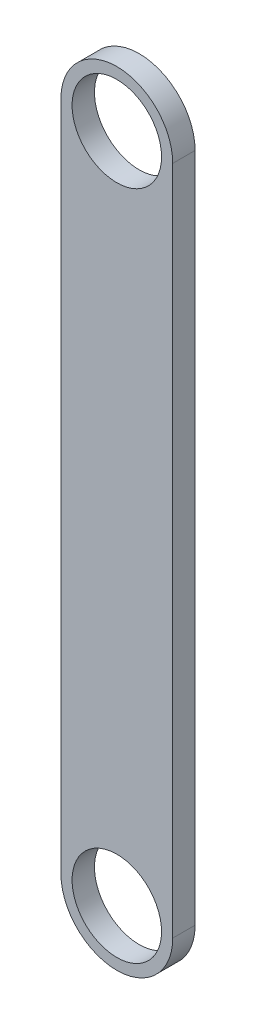
ISO-10303-21;
HEADER;
FILE_DESCRIPTION(('STEP AP214'),'2;1');
FILE_NAME('part.step','',(''),(''),'','','');
FILE_SCHEMA(('AUTOMOTIVE_DESIGN { 1 0 10303 214 1 1 1 1 }'));
ENDSEC;
DATA;
#1=APPLICATION_CONTEXT('core data for automotive mechanical design processes');
#2=APPLICATION_PROTOCOL_DEFINITION('international standard','automotive_design',2000,#1);
#3=PRODUCT_CONTEXT('',#1,'mechanical');
#4=PRODUCT('Part','Part','',(#3));
#5=PRODUCT_RELATED_PRODUCT_CATEGORY('part','',(#4));
#6=PRODUCT_DEFINITION_FORMATION('','',#4);
#7=PRODUCT_DEFINITION_CONTEXT('part definition',#1,'design');
#8=PRODUCT_DEFINITION('design','',#6,#7);
#9=PRODUCT_DEFINITION_SHAPE('','',#8);
#10=(LENGTH_UNIT() NAMED_UNIT(*) SI_UNIT(.MILLI.,.METRE.));
#11=(NAMED_UNIT(*) PLANE_ANGLE_UNIT() SI_UNIT($,.RADIAN.));
#12=(NAMED_UNIT(*) SI_UNIT($,.STERADIAN.) SOLID_ANGLE_UNIT());
#13=UNCERTAINTY_MEASURE_WITH_UNIT(LENGTH_MEASURE(1.E-05),#10,'distance_accuracy_value','');
#14=(GEOMETRIC_REPRESENTATION_CONTEXT(3) GLOBAL_UNCERTAINTY_ASSIGNED_CONTEXT((#13)) GLOBAL_UNIT_ASSIGNED_CONTEXT((#10,
#11,#12)) REPRESENTATION_CONTEXT('',''));
#15=CARTESIAN_POINT('',(0.,0.,0.));
#16=DIRECTION('',(0.,0.,1.));
#17=DIRECTION('',(1.,0.,0.));
#18=AXIS2_PLACEMENT_3D('',#15,#16,#17);
#19=CARTESIAN_POINT('',(2.56665593577974E-13,-15.,5.5));
#20=DIRECTION('',(0.,0.,1.));
#21=DIRECTION('',(1.,0.,0.));
#22=AXIS2_PLACEMENT_3D('',#19,#20,#21);
#23=PLANE('',#22);
#24=CARTESIAN_POINT('',(2.55073552739082E-13,15.,5.5));
#25=DIRECTION('',(0.,0.,1.));
#26=DIRECTION('',(1.,0.,0.));
#27=AXIS2_PLACEMENT_3D('',#24,#25,#26);
#28=CIRCLE('',#27,2.);
#29=CARTESIAN_POINT('',(2.00000000000025,15.,5.5));
#30=VERTEX_POINT('',#29);
#31=EDGE_CURVE('E112',#30,#30,#28,.T.);
#32=ORIENTED_EDGE('',*,*,#31,.F.);
#33=EDGE_LOOP('',(#32));
#34=FACE_BOUND('',#33,.T.);
#35=CARTESIAN_POINT('',(2.56665593577974E-13,-15.,5.5));
#36=DIRECTION('',(0.,0.,1.));
#37=DIRECTION('',(1.,0.,0.));
#38=AXIS2_PLACEMENT_3D('',#35,#36,#37);
#39=CIRCLE('',#38,2.5);
#40=CARTESIAN_POINT('',(-2.49999999999975,-15.,5.5));
#41=VERTEX_POINT('',#40);
#42=CARTESIAN_POINT('',(2.50000000000026,-15.,5.5));
#43=VERTEX_POINT('',#42);
#44=EDGE_CURVE('E92',#41,#43,#39,.T.);
#45=ORIENTED_EDGE('',*,*,#44,.T.);
#46=DIRECTION('',(0.,1.,0.));
#47=VECTOR('',#46,1.);
#48=CARTESIAN_POINT('',(2.50000000000026,-15.,5.5));
#49=LINE('',#48,#47);
#50=CARTESIAN_POINT('',(2.50000000000026,15.,5.5));
#51=VERTEX_POINT('',#50);
#52=EDGE_CURVE('E87',#43,#51,#49,.T.);
#53=ORIENTED_EDGE('',*,*,#52,.T.);
#54=CARTESIAN_POINT('',(2.55073552739082E-13,15.,5.5));
#55=DIRECTION('',(0.,0.,1.));
#56=DIRECTION('',(1.,0.,0.));
#57=AXIS2_PLACEMENT_3D('',#54,#55,#56);
#58=CIRCLE('',#57,2.5);
#59=CARTESIAN_POINT('',(-2.49999999999975,15.,5.5));
#60=VERTEX_POINT('',#59);
#61=EDGE_CURVE('E90',#51,#60,#58,.T.);
#62=ORIENTED_EDGE('',*,*,#61,.T.);
#63=DIRECTION('',(0.,-1.,0.));
#64=VECTOR('',#63,1.);
#65=CARTESIAN_POINT('',(-2.49999999999975,-15.,5.5));
#66=LINE('',#65,#64);
#67=EDGE_CURVE('E57',#60,#41,#66,.T.);
#68=ORIENTED_EDGE('',*,*,#67,.T.);
#69=EDGE_LOOP('',(#45,#53,#62,#68));
#70=FACE_BOUND('',#69,.T.);
#71=CARTESIAN_POINT('',(2.56665593577974E-13,-15.,5.5));
#72=DIRECTION('',(0.,0.,1.));
#73=DIRECTION('',(1.,0.,0.));
#74=AXIS2_PLACEMENT_3D('',#71,#72,#73);
#75=CIRCLE('',#74,2.);
#76=CARTESIAN_POINT('',(2.00000000000026,-15.,5.5));
#77=VERTEX_POINT('',#76);
#78=EDGE_CURVE('E134',#77,#77,#75,.T.);
#79=ORIENTED_EDGE('',*,*,#78,.F.);
#80=EDGE_LOOP('',(#79));
#81=FACE_BOUND('',#80,.T.);
#82=ADVANCED_FACE('F39',(#34,#70,#81),#23,.T.);
#83=CARTESIAN_POINT('',(2.56665593577974E-13,-15.,4.5));
#84=DIRECTION('',(0.,0.,1.));
#85=DIRECTION('',(1.,0.,0.));
#86=AXIS2_PLACEMENT_3D('',#83,#84,#85);
#87=PLANE('',#86);
#88=CARTESIAN_POINT('',(2.56665593577974E-13,-15.,4.5));
#89=DIRECTION('',(0.,0.,1.));
#90=DIRECTION('',(1.,0.,0.));
#91=AXIS2_PLACEMENT_3D('',#88,#89,#90);
#92=CIRCLE('',#91,2.5);
#93=CARTESIAN_POINT('',(-2.49999999999975,-15.,4.5));
#94=VERTEX_POINT('',#93);
#95=CARTESIAN_POINT('',(2.50000000000026,-15.,4.5));
#96=VERTEX_POINT('',#95);
#97=EDGE_CURVE('E108',#94,#96,#92,.T.);
#98=ORIENTED_EDGE('',*,*,#97,.F.);
#99=DIRECTION('',(0.,-1.,0.));
#100=VECTOR('',#99,1.);
#101=CARTESIAN_POINT('',(-2.49999999999975,-15.,4.5));
#102=LINE('',#101,#100);
#103=CARTESIAN_POINT('',(-2.49999999999975,15.,4.5));
#104=VERTEX_POINT('',#103);
#105=EDGE_CURVE('E80',#104,#94,#102,.T.);
#106=ORIENTED_EDGE('',*,*,#105,.F.);
#107=CARTESIAN_POINT('',(2.55073552739082E-13,15.,4.5));
#108=DIRECTION('',(0.,0.,1.));
#109=DIRECTION('',(1.,0.,0.));
#110=AXIS2_PLACEMENT_3D('',#107,#108,#109);
#111=CIRCLE('',#110,2.5);
#112=CARTESIAN_POINT('',(2.50000000000026,15.,4.5));
#113=VERTEX_POINT('',#112);
#114=EDGE_CURVE('E74',#113,#104,#111,.T.);
#115=ORIENTED_EDGE('',*,*,#114,.F.);
#116=DIRECTION('',(0.,1.,0.));
#117=VECTOR('',#116,1.);
#118=CARTESIAN_POINT('',(2.50000000000026,-15.,4.5));
#119=LINE('',#118,#117);
#120=EDGE_CURVE('E97',#96,#113,#119,.T.);
#121=ORIENTED_EDGE('',*,*,#120,.F.);
#122=EDGE_LOOP('',(#98,#106,#115,#121));
#123=FACE_BOUND('',#122,.T.);
#124=CARTESIAN_POINT('',(2.55073552739082E-13,15.,4.5));
#125=DIRECTION('',(0.,0.,1.));
#126=DIRECTION('',(1.,0.,0.));
#127=AXIS2_PLACEMENT_3D('',#124,#125,#126);
#128=CIRCLE('',#127,2.);
#129=CARTESIAN_POINT('',(2.00000000000025,15.,4.5));
#130=VERTEX_POINT('',#129);
#131=EDGE_CURVE('E130',#130,#130,#128,.T.);
#132=ORIENTED_EDGE('',*,*,#131,.T.);
#133=EDGE_LOOP('',(#132));
#134=FACE_BOUND('',#133,.T.);
#135=CARTESIAN_POINT('',(2.56665593577974E-13,-15.,4.5));
#136=DIRECTION('',(0.,0.,1.));
#137=DIRECTION('',(1.,0.,0.));
#138=AXIS2_PLACEMENT_3D('',#135,#136,#137);
#139=CIRCLE('',#138,2.);
#140=CARTESIAN_POINT('',(2.00000000000026,-15.,4.5));
#141=VERTEX_POINT('',#140);
#142=EDGE_CURVE('E138',#141,#141,#139,.T.);
#143=ORIENTED_EDGE('',*,*,#142,.T.);
#144=EDGE_LOOP('',(#143));
#145=FACE_BOUND('',#144,.T.);
#146=ADVANCED_FACE('F125',(#123,#134,#145),#87,.F.);
#147=CARTESIAN_POINT('',(2.56665593577974E-13,-15.,5.5));
#148=DIRECTION('',(0.,0.,-1.));
#149=DIRECTION('',(-1.,0.,0.));
#150=AXIS2_PLACEMENT_3D('',#147,#148,#149);
#151=CYLINDRICAL_SURFACE('',#150,2.5);
#152=ORIENTED_EDGE('',*,*,#97,.T.);
#153=DIRECTION('',(0.,0.,-1.));
#154=VECTOR('',#153,1.);
#155=CARTESIAN_POINT('',(2.50000000000026,-15.,5.5));
#156=LINE('',#155,#154);
#157=EDGE_CURVE('E11',#43,#96,#156,.T.);
#158=ORIENTED_EDGE('',*,*,#157,.F.);
#159=ORIENTED_EDGE('',*,*,#44,.F.);
#160=DIRECTION('',(0.,0.,-1.));
#161=VECTOR('',#160,1.);
#162=CARTESIAN_POINT('',(-2.49999999999975,-15.,5.5));
#163=LINE('',#162,#161);
#164=EDGE_CURVE('E104',#41,#94,#163,.T.);
#165=ORIENTED_EDGE('',*,*,#164,.T.);
#166=EDGE_LOOP('',(#152,#158,#159,#165));
#167=FACE_BOUND('',#166,.T.);
#168=ADVANCED_FACE('F41',(#167),#151,.T.);
#169=CARTESIAN_POINT('',(2.50000000000026,-15.,5.5));
#170=DIRECTION('',(-1.,0.,0.));
#171=DIRECTION('',(0.,0.,1.));
#172=AXIS2_PLACEMENT_3D('',#169,#170,#171);
#173=PLANE('',#172);
#174=ORIENTED_EDGE('',*,*,#120,.T.);
#175=DIRECTION('',(0.,0.,-1.));
#176=VECTOR('',#175,1.);
#177=CARTESIAN_POINT('',(2.50000000000026,15.,5.5));
#178=LINE('',#177,#176);
#179=EDGE_CURVE('E49',#51,#113,#178,.T.);
#180=ORIENTED_EDGE('',*,*,#179,.F.);
#181=ORIENTED_EDGE('',*,*,#52,.F.);
#182=ORIENTED_EDGE('',*,*,#157,.T.);
#183=EDGE_LOOP('',(#174,#180,#181,#182));
#184=FACE_BOUND('',#183,.T.);
#185=ADVANCED_FACE('F96',(#184),#173,.F.);
#186=CARTESIAN_POINT('',(2.55073552739082E-13,15.,5.5));
#187=DIRECTION('',(0.,0.,-1.));
#188=DIRECTION('',(-1.,0.,0.));
#189=AXIS2_PLACEMENT_3D('',#186,#187,#188);
#190=CYLINDRICAL_SURFACE('',#189,2.5);
#191=ORIENTED_EDGE('',*,*,#114,.T.);
#192=DIRECTION('',(0.,0.,-1.));
#193=VECTOR('',#192,1.);
#194=CARTESIAN_POINT('',(-2.49999999999975,15.,5.5));
#195=LINE('',#194,#193);
#196=EDGE_CURVE('E99',#60,#104,#195,.T.);
#197=ORIENTED_EDGE('',*,*,#196,.F.);
#198=ORIENTED_EDGE('',*,*,#61,.F.);
#199=ORIENTED_EDGE('',*,*,#179,.T.);
#200=EDGE_LOOP('',(#191,#197,#198,#199));
#201=FACE_BOUND('',#200,.T.);
#202=ADVANCED_FACE('F100',(#201),#190,.T.);
#203=CARTESIAN_POINT('',(-2.49999999999975,-15.,5.5));
#204=DIRECTION('',(1.,0.,0.));
#205=DIRECTION('',(0.,1.,0.));
#206=AXIS2_PLACEMENT_3D('',#203,#204,#205);
#207=PLANE('',#206);
#208=ORIENTED_EDGE('',*,*,#105,.T.);
#209=ORIENTED_EDGE('',*,*,#164,.F.);
#210=ORIENTED_EDGE('',*,*,#67,.F.);
#211=ORIENTED_EDGE('',*,*,#196,.T.);
#212=EDGE_LOOP('',(#208,#209,#210,#211));
#213=FACE_BOUND('',#212,.T.);
#214=ADVANCED_FACE('F122',(#213),#207,.F.);
#215=CARTESIAN_POINT('',(2.55073552739082E-13,15.,5.5));
#216=DIRECTION('',(0.,0.,-1.));
#217=DIRECTION('',(-1.,0.,0.));
#218=AXIS2_PLACEMENT_3D('',#215,#216,#217);
#219=CYLINDRICAL_SURFACE('',#218,2.);
#220=ORIENTED_EDGE('',*,*,#31,.T.);
#221=EDGE_LOOP('',(#220));
#222=FACE_BOUND('',#221,.T.);
#223=ORIENTED_EDGE('',*,*,#131,.F.);
#224=EDGE_LOOP('',(#223));
#225=FACE_BOUND('',#224,.T.);
#226=ADVANCED_FACE('F157',(#222,#225),#219,.F.);
#227=CARTESIAN_POINT('',(2.56665593577974E-13,-15.,5.5));
#228=DIRECTION('',(0.,0.,-1.));
#229=DIRECTION('',(-1.,0.,0.));
#230=AXIS2_PLACEMENT_3D('',#227,#228,#229);
#231=CYLINDRICAL_SURFACE('',#230,2.);
#232=ORIENTED_EDGE('',*,*,#78,.T.);
#233=EDGE_LOOP('',(#232));
#234=FACE_BOUND('',#233,.T.);
#235=ORIENTED_EDGE('',*,*,#142,.F.);
#236=EDGE_LOOP('',(#235));
#237=FACE_BOUND('',#236,.T.);
#238=ADVANCED_FACE('F146',(#234,#237),#231,.F.);
#239=CLOSED_SHELL('',(#82,#146,#168,#185,#202,#214,#226,#238));
#240=MANIFOLD_SOLID_BREP('B2',#239);
#241=ADVANCED_BREP_SHAPE_REPRESENTATION('',(#18,#240),#14);
#242=SHAPE_DEFINITION_REPRESENTATION(#9,#241);
ENDSEC;
END-ISO-10303-21;
